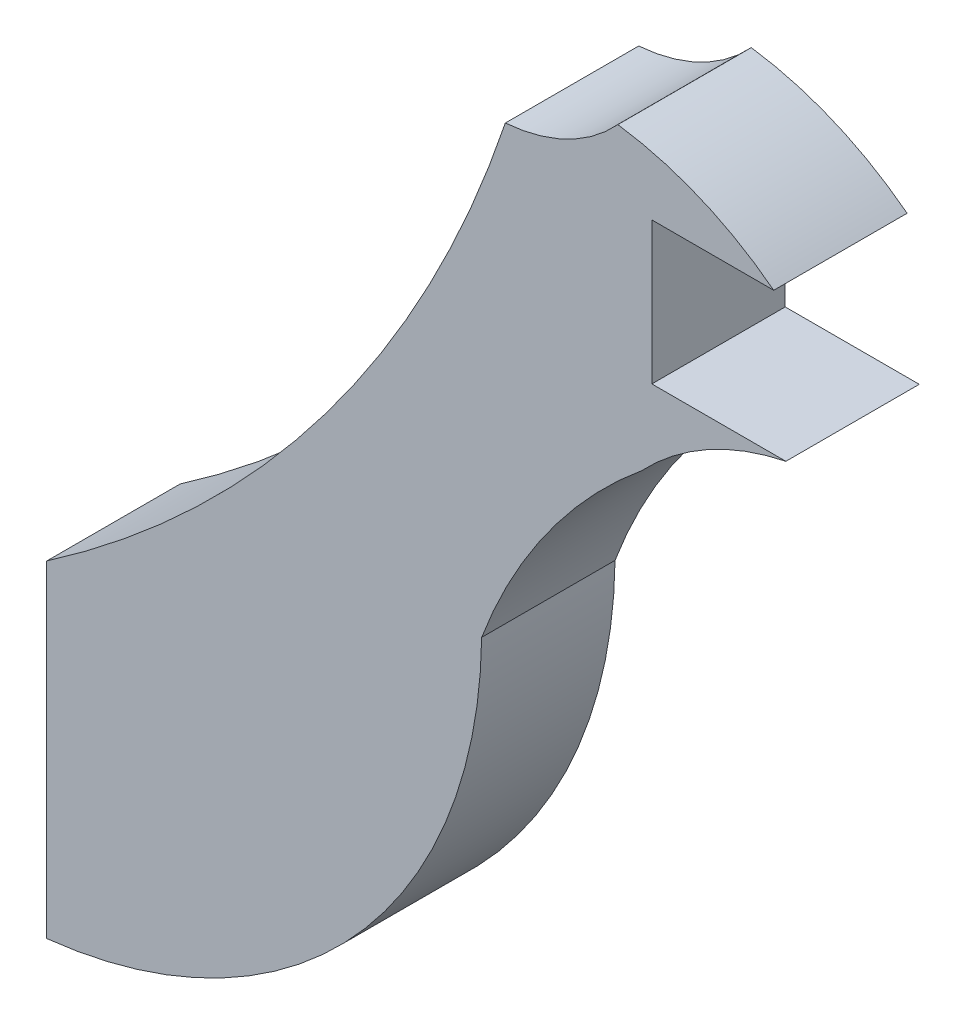
ISO-10303-21;
HEADER;
FILE_DESCRIPTION(('STEP AP214'),'2;1');
FILE_NAME('part.step','',(''),(''),'','','');
FILE_SCHEMA(('AUTOMOTIVE_DESIGN { 1 0 10303 214 1 1 1 1 }'));
ENDSEC;
DATA;
#1=APPLICATION_CONTEXT('core data for automotive mechanical design processes');
#2=APPLICATION_PROTOCOL_DEFINITION('international standard','automotive_design',2000,#1);
#3=PRODUCT_CONTEXT('',#1,'mechanical');
#4=PRODUCT('Part','Part','',(#3));
#5=PRODUCT_RELATED_PRODUCT_CATEGORY('part','',(#4));
#6=PRODUCT_DEFINITION_FORMATION('','',#4);
#7=PRODUCT_DEFINITION_CONTEXT('part definition',#1,'design');
#8=PRODUCT_DEFINITION('design','',#6,#7);
#9=PRODUCT_DEFINITION_SHAPE('','',#8);
#10=(LENGTH_UNIT() NAMED_UNIT(*) SI_UNIT(.MILLI.,.METRE.));
#11=(NAMED_UNIT(*) PLANE_ANGLE_UNIT() SI_UNIT($,.RADIAN.));
#12=(NAMED_UNIT(*) SI_UNIT($,.STERADIAN.) SOLID_ANGLE_UNIT());
#13=UNCERTAINTY_MEASURE_WITH_UNIT(LENGTH_MEASURE(1.E-05),#10,'distance_accuracy_value','');
#14=(GEOMETRIC_REPRESENTATION_CONTEXT(3) GLOBAL_UNCERTAINTY_ASSIGNED_CONTEXT((#13)) GLOBAL_UNIT_ASSIGNED_CONTEXT((#10,
#11,#12)) REPRESENTATION_CONTEXT('',''));
#15=CARTESIAN_POINT('',(0.,0.,0.));
#16=DIRECTION('',(0.,0.,1.));
#17=DIRECTION('',(1.,0.,0.));
#18=AXIS2_PLACEMENT_3D('',#15,#16,#17);
#19=CARTESIAN_POINT('',(111.44978119426,-4.5879806954406,1.524));
#20=DIRECTION('',(0.,0.,-1.));
#21=DIRECTION('',(-1.,0.,0.));
#22=AXIS2_PLACEMENT_3D('',#19,#20,#21);
#23=CYLINDRICAL_SURFACE('',#22,3.12715979824302);
#24=CARTESIAN_POINT('',(111.44978119426,-4.5879806954406,0.));
#25=DIRECTION('',(0.,0.,-1.));
#26=DIRECTION('',(1.,0.,0.));
#27=AXIS2_PLACEMENT_3D('',#24,#25,#26);
#28=CIRCLE('',#27,3.12715979824302);
#29=CARTESIAN_POINT('',(109.178159994466,-2.43882608760206,0.));
#30=VERTEX_POINT('',#29);
#31=CARTESIAN_POINT('',(110.824360774291,-1.524,0.));
#32=VERTEX_POINT('',#31);
#33=EDGE_CURVE('E143',#30,#32,#28,.T.);
#34=ORIENTED_EDGE('',*,*,#33,.T.);
#35=DIRECTION('',(0.,0.,-1.));
#36=VECTOR('',#35,1.);
#37=CARTESIAN_POINT('',(110.824360774291,-1.524,1.524));
#38=LINE('',#37,#36);
#39=CARTESIAN_POINT('',(110.824360774291,-1.524,1.524));
#40=VERTEX_POINT('',#39);
#41=EDGE_CURVE('E11',#40,#32,#38,.T.);
#42=ORIENTED_EDGE('',*,*,#41,.F.);
#43=CARTESIAN_POINT('',(111.44978119426,-4.5879806954406,1.524));
#44=DIRECTION('',(0.,0.,-1.));
#45=DIRECTION('',(1.,0.,0.));
#46=AXIS2_PLACEMENT_3D('',#43,#44,#45);
#47=CIRCLE('',#46,3.12715979824302);
#48=CARTESIAN_POINT('',(109.178159994466,-2.43882608760206,1.524));
#49=VERTEX_POINT('',#48);
#50=EDGE_CURVE('E161',#49,#40,#47,.T.);
#51=ORIENTED_EDGE('',*,*,#50,.F.);
#52=DIRECTION('',(0.,0.,-1.));
#53=VECTOR('',#52,1.);
#54=CARTESIAN_POINT('',(109.178159994466,-2.43882608760206,1.524));
#55=LINE('',#54,#53);
#56=EDGE_CURVE('E139',#49,#30,#55,.T.);
#57=ORIENTED_EDGE('',*,*,#56,.T.);
#58=EDGE_LOOP('',(#34,#42,#51,#57));
#59=FACE_BOUND('',#58,.T.);
#60=ADVANCED_FACE('F35',(#59),#23,.F.);
#61=CARTESIAN_POINT('',(110.824360774291,-1.524,1.524));
#62=DIRECTION('',(0.,-1.,0.));
#63=DIRECTION('',(1.,0.,0.));
#64=AXIS2_PLACEMENT_3D('',#61,#62,#63);
#65=PLANE('',#64);
#66=DIRECTION('',(-1.,0.,0.));
#67=VECTOR('',#66,1.);
#68=CARTESIAN_POINT('',(110.824360774291,-1.524,0.));
#69=LINE('',#68,#67);
#70=CARTESIAN_POINT('',(109.292923469866,-1.524,0.));
#71=VERTEX_POINT('',#70);
#72=EDGE_CURVE('E146',#32,#71,#69,.T.);
#73=ORIENTED_EDGE('',*,*,#72,.T.);
#74=DIRECTION('',(0.,0.,-1.));
#75=VECTOR('',#74,1.);
#76=CARTESIAN_POINT('',(109.292923469866,-1.524,1.524));
#77=LINE('',#76,#75);
#78=CARTESIAN_POINT('',(109.292923469866,-1.524,1.524));
#79=VERTEX_POINT('',#78);
#80=EDGE_CURVE('E43',#79,#71,#77,.T.);
#81=ORIENTED_EDGE('',*,*,#80,.F.);
#82=DIRECTION('',(-1.,0.,0.));
#83=VECTOR('',#82,1.);
#84=CARTESIAN_POINT('',(110.824360774291,-1.524,1.524));
#85=LINE('',#84,#83);
#86=EDGE_CURVE('E100',#40,#79,#85,.T.);
#87=ORIENTED_EDGE('',*,*,#86,.F.);
#88=ORIENTED_EDGE('',*,*,#41,.T.);
#89=EDGE_LOOP('',(#73,#81,#87,#88));
#90=FACE_BOUND('',#89,.T.);
#91=ADVANCED_FACE('F210',(#90),#65,.F.);
#92=CARTESIAN_POINT('',(109.292923469866,-1.524,1.524));
#93=DIRECTION('',(-1.,0.,0.));
#94=DIRECTION('',(0.,0.,1.));
#95=AXIS2_PLACEMENT_3D('',#92,#93,#94);
#96=PLANE('',#95);
#97=DIRECTION('',(0.,1.,0.));
#98=VECTOR('',#97,1.);
#99=CARTESIAN_POINT('',(109.292923469866,-1.524,0.));
#100=LINE('',#99,#98);
#101=CARTESIAN_POINT('',(109.292923469866,0.0992544250664196,0.));
#102=VERTEX_POINT('',#101);
#103=EDGE_CURVE('E148',#71,#102,#100,.T.);
#104=ORIENTED_EDGE('',*,*,#103,.T.);
#105=DIRECTION('',(0.,0.,-1.));
#106=VECTOR('',#105,1.);
#107=CARTESIAN_POINT('',(109.292923469866,0.0992544250664196,1.524));
#108=LINE('',#107,#106);
#109=CARTESIAN_POINT('',(109.292923469866,0.0992544250664196,1.524));
#110=VERTEX_POINT('',#109);
#111=EDGE_CURVE('E174',#110,#102,#108,.T.);
#112=ORIENTED_EDGE('',*,*,#111,.F.);
#113=DIRECTION('',(0.,1.,0.));
#114=VECTOR('',#113,1.);
#115=CARTESIAN_POINT('',(109.292923469866,-1.524,1.524));
#116=LINE('',#115,#114);
#117=EDGE_CURVE('E182',#79,#110,#116,.T.);
#118=ORIENTED_EDGE('',*,*,#117,.F.);
#119=ORIENTED_EDGE('',*,*,#80,.T.);
#120=EDGE_LOOP('',(#104,#112,#118,#119));
#121=FACE_BOUND('',#120,.T.);
#122=ADVANCED_FACE('F180',(#121),#96,.F.);
#123=CARTESIAN_POINT('',(109.292923469866,0.0992544250664196,1.524));
#124=DIRECTION('',(0.,1.,0.));
#125=DIRECTION('',(0.,0.,1.));
#126=AXIS2_PLACEMENT_3D('',#123,#124,#125);
#127=PLANE('',#126);
#128=DIRECTION('',(1.,0.,0.));
#129=VECTOR('',#128,1.);
#130=CARTESIAN_POINT('',(109.292923469866,0.0992544250664196,0.));
#131=LINE('',#130,#129);
#132=CARTESIAN_POINT('',(110.685720546428,0.0992544250664196,0.));
#133=VERTEX_POINT('',#132);
#134=EDGE_CURVE('E150',#102,#133,#131,.T.);
#135=ORIENTED_EDGE('',*,*,#134,.T.);
#136=DIRECTION('',(0.,0.,-1.));
#137=VECTOR('',#136,1.);
#138=CARTESIAN_POINT('',(110.685720546428,0.0992544250664196,1.524));
#139=LINE('',#138,#137);
#140=CARTESIAN_POINT('',(110.685720546428,0.0992544250664196,1.524));
#141=VERTEX_POINT('',#140);
#142=EDGE_CURVE('E171',#141,#133,#139,.T.);
#143=ORIENTED_EDGE('',*,*,#142,.F.);
#144=DIRECTION('',(1.,0.,0.));
#145=VECTOR('',#144,1.);
#146=CARTESIAN_POINT('',(109.292923469866,0.0992544250664196,1.524));
#147=LINE('',#146,#145);
#148=EDGE_CURVE('E200',#110,#141,#147,.T.);
#149=ORIENTED_EDGE('',*,*,#148,.F.);
#150=ORIENTED_EDGE('',*,*,#111,.T.);
#151=EDGE_LOOP('',(#135,#143,#149,#150));
#152=FACE_BOUND('',#151,.T.);
#153=ADVANCED_FACE('F191',(#152),#127,.F.);
#154=CARTESIAN_POINT('',(108.385273024042,-2.87944894111646,1.524));
#155=DIRECTION('',(0.,0.,-1.));
#156=DIRECTION('',(-1.,0.,0.));
#157=AXIS2_PLACEMENT_3D('',#154,#155,#156);
#158=CYLINDRICAL_SURFACE('',#157,3.76360632199525);
#159=CARTESIAN_POINT('',(108.385273024042,-2.87944894111646,0.));
#160=DIRECTION('',(0.,0.,1.));
#161=DIRECTION('',(1.,0.,0.));
#162=AXIS2_PLACEMENT_3D('',#159,#160,#161);
#163=CIRCLE('',#162,3.76360632199525);
#164=CARTESIAN_POINT('',(108.904790048143,0.848128638040178,0.));
#165=VERTEX_POINT('',#164);
#166=EDGE_CURVE('E152',#133,#165,#163,.T.);
#167=ORIENTED_EDGE('',*,*,#166,.T.);
#168=DIRECTION('',(0.,0.,-1.));
#169=VECTOR('',#168,1.);
#170=CARTESIAN_POINT('',(108.904790048143,0.848128638040178,1.524));
#171=LINE('',#170,#169);
#172=CARTESIAN_POINT('',(108.904790048143,0.848128638040178,1.524));
#173=VERTEX_POINT('',#172);
#174=EDGE_CURVE('E168',#173,#165,#171,.T.);
#175=ORIENTED_EDGE('',*,*,#174,.F.);
#176=CARTESIAN_POINT('',(108.385273024042,-2.87944894111646,1.524));
#177=DIRECTION('',(0.,0.,1.));
#178=DIRECTION('',(1.,0.,0.));
#179=AXIS2_PLACEMENT_3D('',#176,#177,#178);
#180=CIRCLE('',#179,3.76360632199525);
#181=EDGE_CURVE('E197',#141,#173,#180,.T.);
#182=ORIENTED_EDGE('',*,*,#181,.F.);
#183=ORIENTED_EDGE('',*,*,#142,.T.);
#184=EDGE_LOOP('',(#167,#175,#182,#183));
#185=FACE_BOUND('',#184,.T.);
#186=ADVANCED_FACE('F195',(#185),#158,.T.);
#187=CARTESIAN_POINT('',(107.468754092672,2.16041351284915,1.524));
#188=DIRECTION('',(0.,0.,-1.));
#189=DIRECTION('',(-1.,0.,0.));
#190=AXIS2_PLACEMENT_3D('',#187,#188,#189);
#191=CYLINDRICAL_SURFACE('',#190,1.945325386165);
#192=CARTESIAN_POINT('',(107.468754092672,2.16041351284915,0.));
#193=DIRECTION('',(0.,0.,-1.));
#194=DIRECTION('',(-1.,0.,0.));
#195=AXIS2_PLACEMENT_3D('',#192,#193,#194);
#196=CIRCLE('',#195,1.945325386165);
#197=CARTESIAN_POINT('',(107.618800979026,0.220883469268073,0.));
#198=VERTEX_POINT('',#197);
#199=EDGE_CURVE('E154',#165,#198,#196,.T.);
#200=ORIENTED_EDGE('',*,*,#199,.T.);
#201=DIRECTION('',(0.,0.,-1.));
#202=VECTOR('',#201,1.);
#203=CARTESIAN_POINT('',(107.618800979026,0.220883469268073,1.524));
#204=LINE('',#203,#202);
#205=CARTESIAN_POINT('',(107.618800979026,0.220883469268073,1.524));
#206=VERTEX_POINT('',#205);
#207=EDGE_CURVE('E165',#206,#198,#204,.T.);
#208=ORIENTED_EDGE('',*,*,#207,.F.);
#209=CARTESIAN_POINT('',(107.468754092672,2.16041351284915,1.524));
#210=DIRECTION('',(0.,0.,-1.));
#211=DIRECTION('',(-1.,0.,0.));
#212=AXIS2_PLACEMENT_3D('',#209,#210,#211);
#213=CIRCLE('',#212,1.945325386165);
#214=EDGE_CURVE('E199',#173,#206,#213,.T.);
#215=ORIENTED_EDGE('',*,*,#214,.F.);
#216=ORIENTED_EDGE('',*,*,#174,.T.);
#217=EDGE_LOOP('',(#200,#208,#215,#216));
#218=FACE_BOUND('',#217,.T.);
#219=ADVANCED_FACE('F222',(#218),#191,.F.);
#220=CARTESIAN_POINT('',(94.5995561761713,4.58015922212509,1.524));
#221=DIRECTION('',(0.,0.,-1.));
#222=DIRECTION('',(-1.,0.,0.));
#223=AXIS2_PLACEMENT_3D('',#220,#221,#222);
#224=CYLINDRICAL_SURFACE('',#223,13.7296766286064);
#225=CARTESIAN_POINT('',(94.5995561761713,4.58015922212509,0.));
#226=DIRECTION('',(0.,0.,-1.));
#227=DIRECTION('',(-1.,0.,0.));
#228=AXIS2_PLACEMENT_3D('',#225,#226,#227);
#229=CIRCLE('',#228,13.7296766286064);
#230=CARTESIAN_POINT('',(102.379001913107,-6.73285294759227,0.));
#231=VERTEX_POINT('',#230);
#232=EDGE_CURVE('E156',#198,#231,#229,.T.);
#233=ORIENTED_EDGE('',*,*,#232,.T.);
#234=DIRECTION('',(0.,0.,-1.));
#235=VECTOR('',#234,1.);
#236=CARTESIAN_POINT('',(102.379001913107,-6.73285294759227,1.524));
#237=LINE('',#236,#235);
#238=CARTESIAN_POINT('',(102.379001913107,-6.73285294759227,1.524));
#239=VERTEX_POINT('',#238);
#240=EDGE_CURVE('E134',#239,#231,#237,.T.);
#241=ORIENTED_EDGE('',*,*,#240,.F.);
#242=CARTESIAN_POINT('',(94.5995561761713,4.58015922212509,1.524));
#243=DIRECTION('',(0.,0.,-1.));
#244=DIRECTION('',(-1.,0.,0.));
#245=AXIS2_PLACEMENT_3D('',#242,#243,#244);
#246=CIRCLE('',#245,13.7296766286064);
#247=EDGE_CURVE('E125',#206,#239,#246,.T.);
#248=ORIENTED_EDGE('',*,*,#247,.F.);
#249=ORIENTED_EDGE('',*,*,#207,.T.);
#250=EDGE_LOOP('',(#233,#241,#248,#249));
#251=FACE_BOUND('',#250,.T.);
#252=ADVANCED_FACE('F225',(#251),#224,.F.);
#253=CARTESIAN_POINT('',(102.379001913107,-6.73285294759228,1.524));
#254=DIRECTION('',(1.,0.,0.));
#255=DIRECTION('',(0.,0.,-1.));
#256=AXIS2_PLACEMENT_3D('',#253,#254,#255);
#257=PLANE('',#256);
#258=DIRECTION('',(0.,-1.,0.));
#259=VECTOR('',#258,1.);
#260=CARTESIAN_POINT('',(102.379001913107,-6.73285294759228,0.));
#261=LINE('',#260,#259);
#262=CARTESIAN_POINT('',(102.379001913107,-10.469177863676,0.));
#263=VERTEX_POINT('',#262);
#264=EDGE_CURVE('E133',#231,#263,#261,.T.);
#265=ORIENTED_EDGE('',*,*,#264,.T.);
#266=DIRECTION('',(0.,0.,-1.));
#267=VECTOR('',#266,1.);
#268=CARTESIAN_POINT('',(102.379001913107,-10.469177863676,1.524));
#269=LINE('',#268,#267);
#270=CARTESIAN_POINT('',(102.379001913107,-10.469177863676,1.524));
#271=VERTEX_POINT('',#270);
#272=EDGE_CURVE('E130',#271,#263,#269,.T.);
#273=ORIENTED_EDGE('',*,*,#272,.F.);
#274=DIRECTION('',(0.,-1.,0.));
#275=VECTOR('',#274,1.);
#276=CARTESIAN_POINT('',(102.379001913107,-6.73285294759228,1.524));
#277=LINE('',#276,#275);
#278=EDGE_CURVE('E119',#239,#271,#277,.T.);
#279=ORIENTED_EDGE('',*,*,#278,.F.);
#280=ORIENTED_EDGE('',*,*,#240,.T.);
#281=EDGE_LOOP('',(#265,#273,#279,#280));
#282=FACE_BOUND('',#281,.T.);
#283=ADVANCED_FACE('F131',(#282),#257,.F.);
#284=CARTESIAN_POINT('',(101.786088174904,-4.93821834818041,1.524));
#285=DIRECTION('',(0.,0.,-1.));
#286=DIRECTION('',(-1.,0.,0.));
#287=AXIS2_PLACEMENT_3D('',#284,#285,#286);
#288=CYLINDRICAL_SURFACE('',#287,5.562648637385);
#289=CARTESIAN_POINT('',(101.786088174904,-4.93821834818041,0.));
#290=DIRECTION('',(0.,0.,1.));
#291=DIRECTION('',(1.,0.,0.));
#292=AXIS2_PLACEMENT_3D('',#289,#290,#291);
#293=CIRCLE('',#292,5.562648637385);
#294=CARTESIAN_POINT('',(107.348345233893,-5.0042204141979,0.));
#295=VERTEX_POINT('',#294);
#296=EDGE_CURVE('E86',#263,#295,#293,.T.);
#297=ORIENTED_EDGE('',*,*,#296,.T.);
#298=DIRECTION('',(0.,0.,-1.));
#299=VECTOR('',#298,1.);
#300=CARTESIAN_POINT('',(107.348345233893,-5.0042204141979,1.524));
#301=LINE('',#300,#299);
#302=CARTESIAN_POINT('',(107.348345233893,-5.0042204141979,1.524));
#303=VERTEX_POINT('',#302);
#304=EDGE_CURVE('E135',#303,#295,#301,.T.);
#305=ORIENTED_EDGE('',*,*,#304,.F.);
#306=CARTESIAN_POINT('',(101.786088174904,-4.93821834818041,1.524));
#307=DIRECTION('',(0.,0.,1.));
#308=DIRECTION('',(1.,0.,0.));
#309=AXIS2_PLACEMENT_3D('',#306,#307,#308);
#310=CIRCLE('',#309,5.562648637385);
#311=EDGE_CURVE('E123',#271,#303,#310,.T.);
#312=ORIENTED_EDGE('',*,*,#311,.F.);
#313=ORIENTED_EDGE('',*,*,#272,.T.);
#314=EDGE_LOOP('',(#297,#305,#312,#313));
#315=FACE_BOUND('',#314,.T.);
#316=ADVANCED_FACE('F137',(#315),#288,.T.);
#317=CARTESIAN_POINT('',(113.048870732765,-7.13495352985057,1.524));
#318=DIRECTION('',(0.,0.,-1.));
#319=DIRECTION('',(-1.,0.,0.));
#320=AXIS2_PLACEMENT_3D('',#317,#318,#319);
#321=CYLINDRICAL_SURFACE('',#320,6.08572218996392);
#322=CARTESIAN_POINT('',(113.048870732765,-7.13495352985057,0.));
#323=DIRECTION('',(0.,0.,-1.));
#324=DIRECTION('',(1.,0.,0.));
#325=AXIS2_PLACEMENT_3D('',#322,#323,#324);
#326=CIRCLE('',#325,6.08572218996392);
#327=EDGE_CURVE('E92',#295,#30,#326,.T.);
#328=ORIENTED_EDGE('',*,*,#327,.T.);
#329=ORIENTED_EDGE('',*,*,#56,.F.);
#330=CARTESIAN_POINT('',(113.048870732765,-7.13495352985057,1.524));
#331=DIRECTION('',(0.,0.,-1.));
#332=DIRECTION('',(1.,0.,0.));
#333=AXIS2_PLACEMENT_3D('',#330,#331,#332);
#334=CIRCLE('',#333,6.08572218996392);
#335=EDGE_CURVE('E51',#303,#49,#334,.T.);
#336=ORIENTED_EDGE('',*,*,#335,.F.);
#337=ORIENTED_EDGE('',*,*,#304,.T.);
#338=EDGE_LOOP('',(#328,#329,#336,#337));
#339=FACE_BOUND('',#338,.T.);
#340=ADVANCED_FACE('F234',(#339),#321,.F.);
#341=CARTESIAN_POINT('',(111.44978119426,-4.5879806954406,1.524));
#342=DIRECTION('',(0.,0.,1.));
#343=DIRECTION('',(1.,0.,0.));
#344=AXIS2_PLACEMENT_3D('',#341,#342,#343);
#345=PLANE('',#344);
#346=ORIENTED_EDGE('',*,*,#50,.T.);
#347=ORIENTED_EDGE('',*,*,#86,.T.);
#348=ORIENTED_EDGE('',*,*,#117,.T.);
#349=ORIENTED_EDGE('',*,*,#148,.T.);
#350=ORIENTED_EDGE('',*,*,#181,.T.);
#351=ORIENTED_EDGE('',*,*,#214,.T.);
#352=ORIENTED_EDGE('',*,*,#247,.T.);
#353=ORIENTED_EDGE('',*,*,#278,.T.);
#354=ORIENTED_EDGE('',*,*,#311,.T.);
#355=ORIENTED_EDGE('',*,*,#335,.T.);
#356=EDGE_LOOP('',(#346,#347,#348,#349,#350,#351,#352,#353,#354,#355));
#357=FACE_BOUND('',#356,.T.);
#358=ADVANCED_FACE('F121',(#357),#345,.T.);
#359=CARTESIAN_POINT('',(111.44978119426,-4.5879806954406,0.));
#360=DIRECTION('',(0.,0.,1.));
#361=DIRECTION('',(1.,0.,0.));
#362=AXIS2_PLACEMENT_3D('',#359,#360,#361);
#363=PLANE('',#362);
#364=ORIENTED_EDGE('',*,*,#33,.F.);
#365=ORIENTED_EDGE('',*,*,#327,.F.);
#366=ORIENTED_EDGE('',*,*,#296,.F.);
#367=ORIENTED_EDGE('',*,*,#264,.F.);
#368=ORIENTED_EDGE('',*,*,#232,.F.);
#369=ORIENTED_EDGE('',*,*,#199,.F.);
#370=ORIENTED_EDGE('',*,*,#166,.F.);
#371=ORIENTED_EDGE('',*,*,#134,.F.);
#372=ORIENTED_EDGE('',*,*,#103,.F.);
#373=ORIENTED_EDGE('',*,*,#72,.F.);
#374=EDGE_LOOP('',(#364,#365,#366,#367,#368,#369,#370,#371,#372,#373));
#375=FACE_BOUND('',#374,.T.);
#376=ADVANCED_FACE('F186',(#375),#363,.F.);
#377=CLOSED_SHELL('',(#60,#91,#122,#153,#186,#219,#252,#283,#316,#340,#358,#376));
#378=MANIFOLD_SOLID_BREP('B2',#377);
#379=ADVANCED_BREP_SHAPE_REPRESENTATION('',(#18,#378),#14);
#380=SHAPE_DEFINITION_REPRESENTATION(#9,#379);
ENDSEC;
END-ISO-10303-21;
